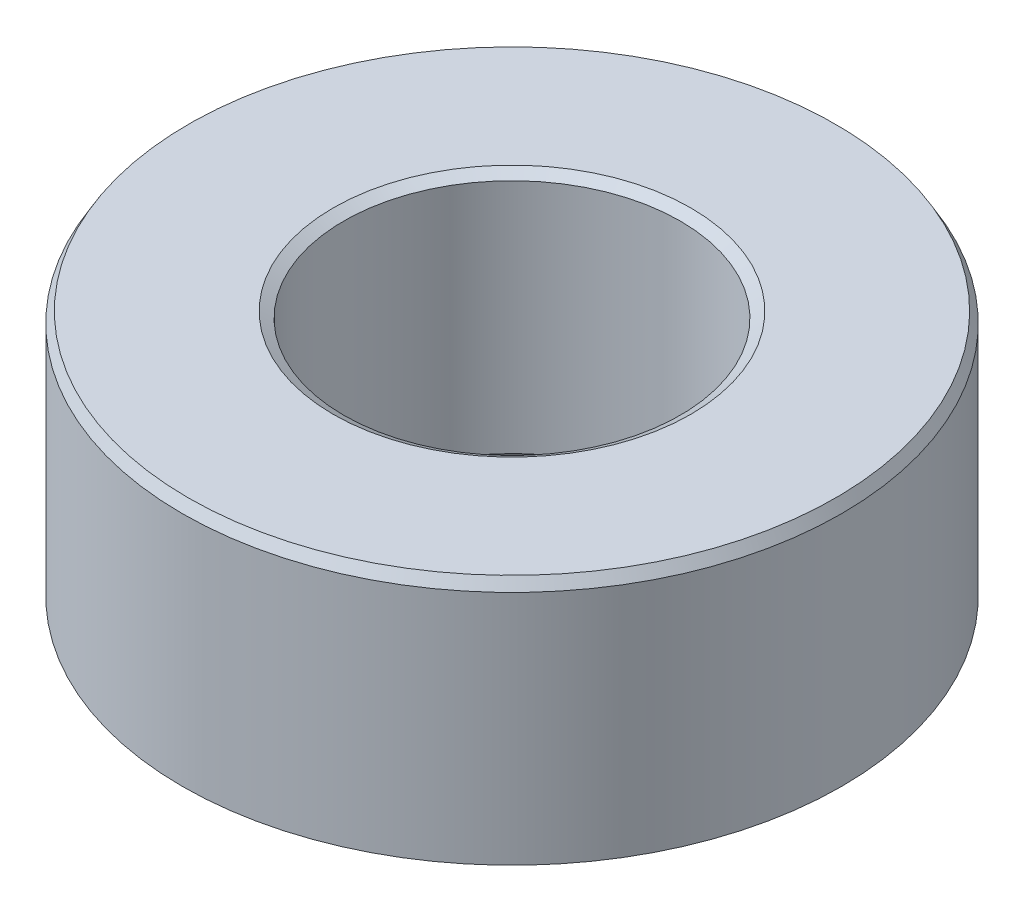
ISO-10303-21;
HEADER;
FILE_DESCRIPTION(('STEP AP214'),'2;1');
FILE_NAME('part.step','',(''),(''),'','','');
FILE_SCHEMA(('AUTOMOTIVE_DESIGN { 1 0 10303 214 1 1 1 1 }'));
ENDSEC;
DATA;
#1=APPLICATION_CONTEXT('core data for automotive mechanical design processes');
#2=APPLICATION_PROTOCOL_DEFINITION('international standard','automotive_design',2000,#1);
#3=PRODUCT_CONTEXT('',#1,'mechanical');
#4=PRODUCT('Part','Part','',(#3));
#5=PRODUCT_RELATED_PRODUCT_CATEGORY('part','',(#4));
#6=PRODUCT_DEFINITION_FORMATION('','',#4);
#7=PRODUCT_DEFINITION_CONTEXT('part definition',#1,'design');
#8=PRODUCT_DEFINITION('design','',#6,#7);
#9=PRODUCT_DEFINITION_SHAPE('','',#8);
#10=(LENGTH_UNIT() NAMED_UNIT(*) SI_UNIT(.MILLI.,.METRE.));
#11=(NAMED_UNIT(*) PLANE_ANGLE_UNIT() SI_UNIT($,.RADIAN.));
#12=(NAMED_UNIT(*) SI_UNIT($,.STERADIAN.) SOLID_ANGLE_UNIT());
#13=UNCERTAINTY_MEASURE_WITH_UNIT(LENGTH_MEASURE(1.E-05),#10,'distance_accuracy_value','');
#14=(GEOMETRIC_REPRESENTATION_CONTEXT(3) GLOBAL_UNCERTAINTY_ASSIGNED_CONTEXT((#13)) GLOBAL_UNIT_ASSIGNED_CONTEXT((#10,
#11,#12)) REPRESENTATION_CONTEXT('',''));
#15=CARTESIAN_POINT('',(0.,0.,0.));
#16=DIRECTION('',(0.,0.,1.));
#17=DIRECTION('',(1.,0.,0.));
#18=AXIS2_PLACEMENT_3D('',#15,#16,#17);
#19=CARTESIAN_POINT('',(0.,7.66935663323915,0.));
#20=DIRECTION('',(0.,-1.,0.));
#21=DIRECTION('',(0.,0.,-1.));
#22=AXIS2_PLACEMENT_3D('',#19,#20,#21);
#23=CYLINDRICAL_SURFACE('',#22,10.);
#24=CARTESIAN_POINT('',(0.,0.184406343964498,0.));
#25=DIRECTION('',(0.,1.,0.));
#26=DIRECTION('',(0.,0.,1.));
#27=AXIS2_PLACEMENT_3D('',#24,#25,#26);
#28=CIRCLE('',#27,10.);
#29=CARTESIAN_POINT('',(0.,0.184406343964498,10.));
#30=VERTEX_POINT('',#29);
#31=EDGE_CURVE('E10',#30,#30,#28,.T.);
#32=ORIENTED_EDGE('',*,*,#31,.T.);
#33=EDGE_LOOP('',(#32));
#34=FACE_BOUND('',#33,.T.);
#35=CARTESIAN_POINT('',(0.,7.3499554762546,0.));
#36=DIRECTION('',(0.,1.,0.));
#37=DIRECTION('',(0.,0.,1.));
#38=AXIS2_PLACEMENT_3D('',#35,#36,#37);
#39=CIRCLE('',#38,10.);
#40=CARTESIAN_POINT('',(0.,7.3499554762546,10.));
#41=VERTEX_POINT('',#40);
#42=EDGE_CURVE('E50',#41,#41,#39,.F.);
#43=ORIENTED_EDGE('',*,*,#42,.T.);
#44=EDGE_LOOP('',(#43));
#45=FACE_BOUND('',#44,.T.);
#46=ADVANCED_FACE('F39',(#34,#45),#23,.T.);
#47=CARTESIAN_POINT('',(0.,7.66935663323915,0.));
#48=DIRECTION('',(0.,1.,0.));
#49=DIRECTION('',(0.,0.,1.));
#50=AXIS2_PLACEMENT_3D('',#47,#48,#49);
#51=PLANE('',#50);
#52=CARTESIAN_POINT('',(0.,7.66935663323915,0.));
#53=DIRECTION('',(0.,1.,0.));
#54=DIRECTION('',(0.,0.,1.));
#55=AXIS2_PLACEMENT_3D('',#52,#53,#54);
#56=CIRCLE('',#55,5.42346387691984);
#57=CARTESIAN_POINT('',(0.,7.66935663323915,5.42346387691984));
#58=VERTEX_POINT('',#57);
#59=EDGE_CURVE('E58',#58,#58,#56,.F.);
#60=ORIENTED_EDGE('',*,*,#59,.T.);
#61=EDGE_LOOP('',(#60));
#62=FACE_BOUND('',#61,.T.);
#63=CARTESIAN_POINT('',(0.,7.66935663323915,0.));
#64=DIRECTION('',(0.,1.,0.));
#65=DIRECTION('',(0.,0.,1.));
#66=AXIS2_PLACEMENT_3D('',#63,#64,#65);
#67=CIRCLE('',#66,9.81559365603549);
#68=CARTESIAN_POINT('',(0.,7.66935663323915,9.81559365603549));
#69=VERTEX_POINT('',#68);
#70=EDGE_CURVE('E61',#69,#69,#67,.T.);
#71=ORIENTED_EDGE('',*,*,#70,.T.);
#72=EDGE_LOOP('',(#71));
#73=FACE_BOUND('',#72,.T.);
#74=ADVANCED_FACE('F88',(#62,#73),#51,.T.);
#75=CARTESIAN_POINT('',(0.,0.,0.));
#76=DIRECTION('',(0.,1.,0.));
#77=DIRECTION('',(0.,0.,1.));
#78=AXIS2_PLACEMENT_3D('',#75,#76,#77);
#79=PLANE('',#78);
#80=CARTESIAN_POINT('',(0.,0.,0.));
#81=DIRECTION('',(0.,1.,0.));
#82=DIRECTION('',(0.,0.,1.));
#83=AXIS2_PLACEMENT_3D('',#80,#81,#82);
#84=CIRCLE('',#83,5.2884690638998);
#85=CARTESIAN_POINT('',(0.,0.,5.2884690638998));
#86=VERTEX_POINT('',#85);
#87=EDGE_CURVE('E51',#86,#86,#84,.T.);
#88=ORIENTED_EDGE('',*,*,#87,.T.);
#89=EDGE_LOOP('',(#88));
#90=FACE_BOUND('',#89,.T.);
#91=CARTESIAN_POINT('',(0.,0.,0.));
#92=DIRECTION('',(0.,1.,0.));
#93=DIRECTION('',(0.,0.,1.));
#94=AXIS2_PLACEMENT_3D('',#91,#92,#93);
#95=CIRCLE('',#94,9.68059884301547);
#96=CARTESIAN_POINT('',(0.,0.,9.68059884301547));
#97=VERTEX_POINT('',#96);
#98=EDGE_CURVE('E54',#97,#97,#95,.F.);
#99=ORIENTED_EDGE('',*,*,#98,.T.);
#100=EDGE_LOOP('',(#99));
#101=FACE_BOUND('',#100,.T.);
#102=ADVANCED_FACE('F83',(#90,#101),#79,.F.);
#103=CARTESIAN_POINT('',(0.,7.66935663323915,0.));
#104=DIRECTION('',(0.,-1.,0.));
#105=DIRECTION('',(0.,0.,-1.));
#106=AXIS2_PLACEMENT_3D('',#103,#104,#105);
#107=CYLINDRICAL_SURFACE('',#106,5.1040627199353);
#108=CARTESIAN_POINT('',(0.,7.48495028927465,0.));
#109=DIRECTION('',(0.,1.,0.));
#110=DIRECTION('',(0.,0.,1.));
#111=AXIS2_PLACEMENT_3D('',#108,#109,#110);
#112=CIRCLE('',#111,5.1040627199353);
#113=CARTESIAN_POINT('',(0.,7.48495028927465,5.1040627199353));
#114=VERTEX_POINT('',#113);
#115=EDGE_CURVE('E67',#114,#114,#112,.T.);
#116=ORIENTED_EDGE('',*,*,#115,.T.);
#117=EDGE_LOOP('',(#116));
#118=FACE_BOUND('',#117,.T.);
#119=CARTESIAN_POINT('',(0.,0.319401156984539,0.));
#120=DIRECTION('',(0.,1.,0.));
#121=DIRECTION('',(0.,0.,1.));
#122=AXIS2_PLACEMENT_3D('',#119,#120,#121);
#123=CIRCLE('',#122,5.1040627199353);
#124=CARTESIAN_POINT('',(0.,0.319401156984539,5.1040627199353));
#125=VERTEX_POINT('',#124);
#126=EDGE_CURVE('E69',#125,#125,#123,.F.);
#127=ORIENTED_EDGE('',*,*,#126,.T.);
#128=EDGE_LOOP('',(#127));
#129=FACE_BOUND('',#128,.T.);
#130=ADVANCED_FACE('F71',(#118,#129),#107,.F.);
#131=CARTESIAN_POINT('',(0.,7.48495028927465,0.));
#132=DIRECTION('',(0.,1.,0.));
#133=DIRECTION('',(0.,0.,1.));
#134=AXIS2_PLACEMENT_3D('',#131,#132,#133);
#135=CONICAL_SURFACE('',#134,5.1040627199353,1.0471975511966);
#136=ORIENTED_EDGE('',*,*,#59,.F.);
#137=EDGE_LOOP('',(#136));
#138=FACE_BOUND('',#137,.T.);
#139=ORIENTED_EDGE('',*,*,#115,.F.);
#140=EDGE_LOOP('',(#139));
#141=FACE_BOUND('',#140,.T.);
#142=ADVANCED_FACE('F77',(#138,#141),#135,.F.);
#143=CARTESIAN_POINT('',(0.,0.,0.));
#144=DIRECTION('',(0.,-1.,0.));
#145=DIRECTION('',(0.,0.,-1.));
#146=AXIS2_PLACEMENT_3D('',#143,#144,#145);
#147=CONICAL_SURFACE('',#146,5.2884690638998,0.523598775598296);
#148=ORIENTED_EDGE('',*,*,#126,.F.);
#149=EDGE_LOOP('',(#148));
#150=FACE_BOUND('',#149,.T.);
#151=ORIENTED_EDGE('',*,*,#87,.F.);
#152=EDGE_LOOP('',(#151));
#153=FACE_BOUND('',#152,.T.);
#154=ADVANCED_FACE('F73',(#150,#153),#147,.F.);
#155=CARTESIAN_POINT('',(0.,0.184406343964498,0.));
#156=DIRECTION('',(0.,1.,0.));
#157=DIRECTION('',(0.,0.,1.));
#158=AXIS2_PLACEMENT_3D('',#155,#156,#157);
#159=CONICAL_SURFACE('',#158,10.,1.0471975511966);
#160=ORIENTED_EDGE('',*,*,#98,.F.);
#161=EDGE_LOOP('',(#160));
#162=FACE_BOUND('',#161,.T.);
#163=ORIENTED_EDGE('',*,*,#31,.F.);
#164=EDGE_LOOP('',(#163));
#165=FACE_BOUND('',#164,.T.);
#166=ADVANCED_FACE('F76',(#162,#165),#159,.T.);
#167=CARTESIAN_POINT('',(0.,7.66935663323915,0.));
#168=DIRECTION('',(0.,-1.,0.));
#169=DIRECTION('',(0.,0.,-1.));
#170=AXIS2_PLACEMENT_3D('',#167,#168,#169);
#171=CONICAL_SURFACE('',#170,9.81559365603549,0.523598775598297);
#172=ORIENTED_EDGE('',*,*,#42,.F.);
#173=EDGE_LOOP('',(#172));
#174=FACE_BOUND('',#173,.T.);
#175=ORIENTED_EDGE('',*,*,#70,.F.);
#176=EDGE_LOOP('',(#175));
#177=FACE_BOUND('',#176,.T.);
#178=ADVANCED_FACE('F45',(#174,#177),#171,.T.);
#179=CLOSED_SHELL('',(#46,#74,#102,#130,#142,#154,#166,#178));
#180=MANIFOLD_SOLID_BREP('B2',#179);
#181=ADVANCED_BREP_SHAPE_REPRESENTATION('',(#18,#180),#14);
#182=SHAPE_DEFINITION_REPRESENTATION(#9,#181);
ENDSEC;
END-ISO-10303-21;
